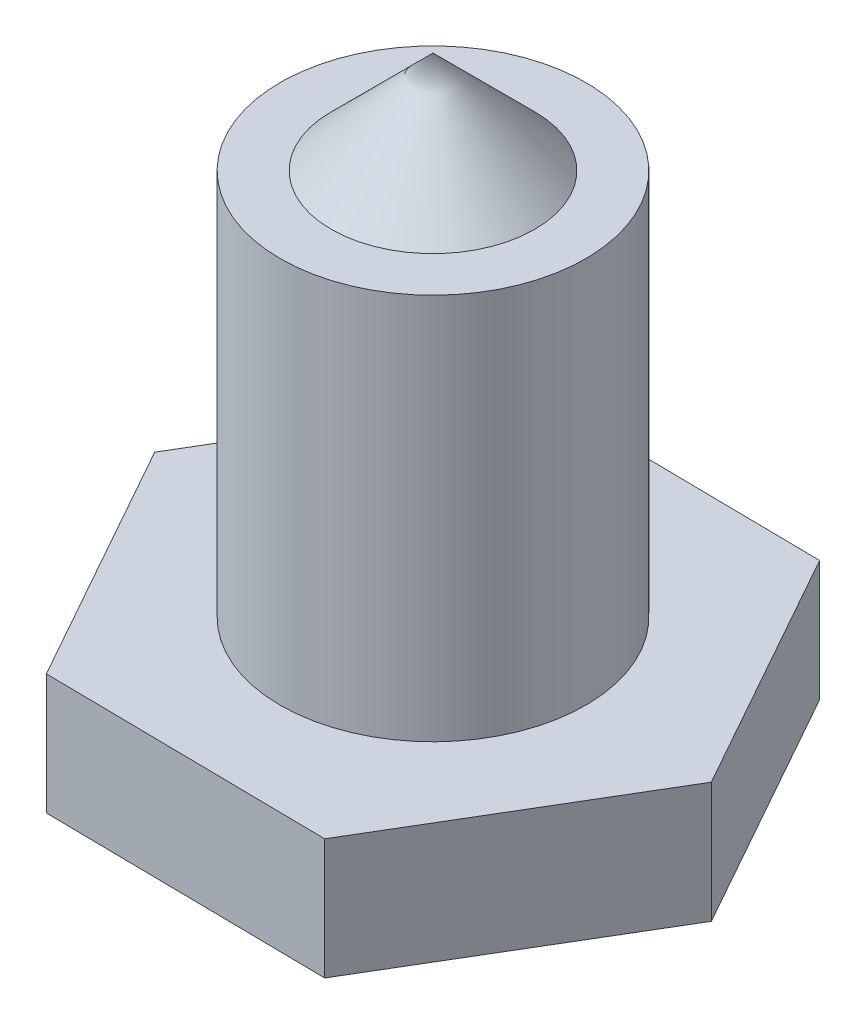
ISO-10303-21;
HEADER;
FILE_DESCRIPTION(('STEP AP214'),'2;1');
FILE_NAME('part.step','',(''),(''),'','','');
FILE_SCHEMA(('AUTOMOTIVE_DESIGN { 1 0 10303 214 1 1 1 1 }'));
ENDSEC;
DATA;
#1=APPLICATION_CONTEXT('core data for automotive mechanical design processes');
#2=APPLICATION_PROTOCOL_DEFINITION('international standard','automotive_design',2000,#1);
#3=PRODUCT_CONTEXT('',#1,'mechanical');
#4=PRODUCT('Part','Part','',(#3));
#5=PRODUCT_RELATED_PRODUCT_CATEGORY('part','',(#4));
#6=PRODUCT_DEFINITION_FORMATION('','',#4);
#7=PRODUCT_DEFINITION_CONTEXT('part definition',#1,'design');
#8=PRODUCT_DEFINITION('design','',#6,#7);
#9=PRODUCT_DEFINITION_SHAPE('','',#8);
#10=(LENGTH_UNIT() NAMED_UNIT(*) SI_UNIT(.MILLI.,.METRE.));
#11=(NAMED_UNIT(*) PLANE_ANGLE_UNIT() SI_UNIT($,.RADIAN.));
#12=(NAMED_UNIT(*) SI_UNIT($,.STERADIAN.) SOLID_ANGLE_UNIT());
#13=UNCERTAINTY_MEASURE_WITH_UNIT(LENGTH_MEASURE(1.E-05),#10,'distance_accuracy_value','');
#14=(GEOMETRIC_REPRESENTATION_CONTEXT(3) GLOBAL_UNCERTAINTY_ASSIGNED_CONTEXT((#13)) GLOBAL_UNIT_ASSIGNED_CONTEXT((#10,
#11,#12)) REPRESENTATION_CONTEXT('',''));
#15=CARTESIAN_POINT('',(0.,0.,0.));
#16=DIRECTION('',(0.,0.,1.));
#17=DIRECTION('',(1.,0.,0.));
#18=AXIS2_PLACEMENT_3D('',#15,#16,#17);
#19=CARTESIAN_POINT('',(10.997565326129,4.7,0.145109949783447));
#20=DIRECTION('',(-0.872546818480198,0.,0.488530500132882));
#21=DIRECTION('',(0.488530500132882,0.,0.872546818480198));
#22=AXIS2_PLACEMENT_3D('',#19,#20,#21);
#23=PLANE('',#22);
#24=DIRECTION('',(-0.488530500132882,0.,-0.872546818480198));
#25=VECTOR('',#24,1.);
#26=CARTESIAN_POINT('',(10.997565326129,0.,0.145109949783447));
#27=LINE('',#26,#25);
#28=CARTESIAN_POINT('',(10.997565326129,0.,0.145109949783447));
#29=VERTEX_POINT('',#28);
#30=CARTESIAN_POINT('',(5.62445156591883,0.,-9.45161597731485));
#31=VERTEX_POINT('',#30);
#32=EDGE_CURVE('E121',#29,#31,#27,.T.);
#33=ORIENTED_EDGE('',*,*,#32,.T.);
#34=DIRECTION('',(0.,-1.,0.));
#35=VECTOR('',#34,1.);
#36=CARTESIAN_POINT('',(5.62445156591883,4.7,-9.45161597731485));
#37=LINE('',#36,#35);
#38=CARTESIAN_POINT('',(5.62445156591883,4.7,-9.45161597731485));
#39=VERTEX_POINT('',#38);
#40=EDGE_CURVE('E42',#39,#31,#37,.T.);
#41=ORIENTED_EDGE('',*,*,#40,.F.);
#42=DIRECTION('',(-0.488530500132882,0.,-0.872546818480198));
#43=VECTOR('',#42,1.);
#44=CARTESIAN_POINT('',(10.997565326129,4.7,0.145109949783447));
#45=LINE('',#44,#43);
#46=CARTESIAN_POINT('',(10.997565326129,4.7,0.145109949783447));
#47=VERTEX_POINT('',#46);
#48=EDGE_CURVE('E132',#47,#39,#45,.T.);
#49=ORIENTED_EDGE('',*,*,#48,.F.);
#50=DIRECTION('',(0.,-1.,0.));
#51=VECTOR('',#50,1.);
#52=CARTESIAN_POINT('',(10.997565326129,4.7,0.145109949783447));
#53=LINE('',#52,#51);
#54=EDGE_CURVE('E117',#47,#29,#53,.T.);
#55=ORIENTED_EDGE('',*,*,#54,.T.);
#56=EDGE_LOOP('',(#33,#41,#49,#55));
#57=FACE_BOUND('',#56,.T.);
#58=ADVANCED_FACE('F34',(#57),#23,.F.);
#59=CARTESIAN_POINT('',(5.62445156591883,4.7,-9.45161597731485));
#60=DIRECTION('',(-0.0131935856015067,0.,0.999912960861582));
#61=DIRECTION('',(0.999912960861582,0.,0.0131935856015067));
#62=AXIS2_PLACEMENT_3D('',#59,#60,#61);
#63=PLANE('',#62);
#64=DIRECTION('',(-0.999912960861582,0.,-0.0131935856015067));
#65=VECTOR('',#64,1.);
#66=CARTESIAN_POINT('',(5.62445156591883,0.,-9.45161597731485));
#67=LINE('',#66,#65);
#68=CARTESIAN_POINT('',(-5.37311376021013,0.,-9.59672592709829));
#69=VERTEX_POINT('',#68);
#70=EDGE_CURVE('E124',#31,#69,#67,.T.);
#71=ORIENTED_EDGE('',*,*,#70,.T.);
#72=DIRECTION('',(0.,-1.,0.));
#73=VECTOR('',#72,1.);
#74=CARTESIAN_POINT('',(-5.37311376021013,4.7,-9.59672592709829));
#75=LINE('',#74,#73);
#76=CARTESIAN_POINT('',(-5.37311376021013,4.7,-9.59672592709829));
#77=VERTEX_POINT('',#76);
#78=EDGE_CURVE('E136',#77,#69,#75,.T.);
#79=ORIENTED_EDGE('',*,*,#78,.F.);
#80=DIRECTION('',(-0.999912960861582,0.,-0.0131935856015067));
#81=VECTOR('',#80,1.);
#82=CARTESIAN_POINT('',(5.62445156591883,4.7,-9.45161597731485));
#83=LINE('',#82,#81);
#84=EDGE_CURVE('E89',#39,#77,#83,.T.);
#85=ORIENTED_EDGE('',*,*,#84,.F.);
#86=ORIENTED_EDGE('',*,*,#40,.T.);
#87=EDGE_LOOP('',(#71,#79,#85,#86));
#88=FACE_BOUND('',#87,.T.);
#89=ADVANCED_FACE('F139',(#88),#63,.F.);
#90=CARTESIAN_POINT('',(-5.37311376021013,4.7,-9.59672592709829));
#91=DIRECTION('',(0.859353232878692,0.,0.5113824607287));
#92=DIRECTION('',(0.5113824607287,0.,-0.859353232878692));
#93=AXIS2_PLACEMENT_3D('',#90,#91,#92);
#94=PLANE('',#93);
#95=DIRECTION('',(-0.5113824607287,0.,0.859353232878692));
#96=VECTOR('',#95,1.);
#97=CARTESIAN_POINT('',(-5.37311376021013,0.,-9.59672592709829));
#98=LINE('',#97,#96);
#99=CARTESIAN_POINT('',(-10.997565326129,0.,-0.145109949783442));
#100=VERTEX_POINT('',#99);
#101=EDGE_CURVE('E127',#69,#100,#98,.T.);
#102=ORIENTED_EDGE('',*,*,#101,.T.);
#103=DIRECTION('',(0.,-1.,0.));
#104=VECTOR('',#103,1.);
#105=CARTESIAN_POINT('',(-10.997565326129,4.7,-0.145109949783442));
#106=LINE('',#105,#104);
#107=CARTESIAN_POINT('',(-10.997565326129,4.7,-0.145109949783442));
#108=VERTEX_POINT('',#107);
#109=EDGE_CURVE('E112',#108,#100,#106,.T.);
#110=ORIENTED_EDGE('',*,*,#109,.F.);
#111=DIRECTION('',(-0.5113824607287,0.,0.859353232878692));
#112=VECTOR('',#111,1.);
#113=CARTESIAN_POINT('',(-5.37311376021013,4.7,-9.59672592709829));
#114=LINE('',#113,#112);
#115=EDGE_CURVE('E103',#77,#108,#114,.T.);
#116=ORIENTED_EDGE('',*,*,#115,.F.);
#117=ORIENTED_EDGE('',*,*,#78,.T.);
#118=EDGE_LOOP('',(#102,#110,#116,#117));
#119=FACE_BOUND('',#118,.T.);
#120=ADVANCED_FACE('F147',(#119),#94,.F.);
#121=CARTESIAN_POINT('',(-10.997565326129,4.7,-0.145109949783442));
#122=DIRECTION('',(0.872546818480198,0.,-0.488530500132882));
#123=DIRECTION('',(-0.488530500132882,0.,-0.872546818480198));
#124=AXIS2_PLACEMENT_3D('',#121,#122,#123);
#125=PLANE('',#124);
#126=DIRECTION('',(0.488530500132882,0.,0.872546818480198));
#127=VECTOR('',#126,1.);
#128=CARTESIAN_POINT('',(-10.997565326129,0.,-0.145109949783442));
#129=LINE('',#128,#127);
#130=CARTESIAN_POINT('',(-5.62445156591882,0.,9.45161597731485));
#131=VERTEX_POINT('',#130);
#132=EDGE_CURVE('E111',#100,#131,#129,.T.);
#133=ORIENTED_EDGE('',*,*,#132,.T.);
#134=DIRECTION('',(0.,-1.,0.));
#135=VECTOR('',#134,1.);
#136=CARTESIAN_POINT('',(-5.62445156591882,4.7,9.45161597731485));
#137=LINE('',#136,#135);
#138=CARTESIAN_POINT('',(-5.62445156591882,4.7,9.45161597731485));
#139=VERTEX_POINT('',#138);
#140=EDGE_CURVE('E108',#139,#131,#137,.T.);
#141=ORIENTED_EDGE('',*,*,#140,.F.);
#142=DIRECTION('',(0.488530500132882,0.,0.872546818480198));
#143=VECTOR('',#142,1.);
#144=CARTESIAN_POINT('',(-10.997565326129,4.7,-0.145109949783442));
#145=LINE('',#144,#143);
#146=EDGE_CURVE('E97',#108,#139,#145,.T.);
#147=ORIENTED_EDGE('',*,*,#146,.F.);
#148=ORIENTED_EDGE('',*,*,#109,.T.);
#149=EDGE_LOOP('',(#133,#141,#147,#148));
#150=FACE_BOUND('',#149,.T.);
#151=ADVANCED_FACE('F109',(#150),#125,.F.);
#152=CARTESIAN_POINT('',(-5.62445156591882,4.7,9.45161597731485));
#153=DIRECTION('',(0.0131935856015065,0.,-0.999912960861582));
#154=DIRECTION('',(-0.999912960861582,0.,-0.0131935856015065));
#155=AXIS2_PLACEMENT_3D('',#152,#153,#154);
#156=PLANE('',#155);
#157=DIRECTION('',(0.999912960861582,0.,0.0131935856015065));
#158=VECTOR('',#157,1.);
#159=CARTESIAN_POINT('',(-5.62445156591882,0.,9.45161597731485));
#160=LINE('',#159,#158);
#161=CARTESIAN_POINT('',(5.37311376021013,0.,9.59672592709829));
#162=VERTEX_POINT('',#161);
#163=EDGE_CURVE('E74',#131,#162,#160,.T.);
#164=ORIENTED_EDGE('',*,*,#163,.T.);
#165=DIRECTION('',(0.,-1.,0.));
#166=VECTOR('',#165,1.);
#167=CARTESIAN_POINT('',(5.37311376021013,4.7,9.59672592709829));
#168=LINE('',#167,#166);
#169=CARTESIAN_POINT('',(5.37311376021013,4.7,9.59672592709829));
#170=VERTEX_POINT('',#169);
#171=EDGE_CURVE('E113',#170,#162,#168,.T.);
#172=ORIENTED_EDGE('',*,*,#171,.F.);
#173=DIRECTION('',(0.999912960861582,0.,0.0131935856015065));
#174=VECTOR('',#173,1.);
#175=CARTESIAN_POINT('',(-5.62445156591882,4.7,9.45161597731485));
#176=LINE('',#175,#174);
#177=EDGE_CURVE('E101',#139,#170,#176,.T.);
#178=ORIENTED_EDGE('',*,*,#177,.F.);
#179=ORIENTED_EDGE('',*,*,#140,.T.);
#180=EDGE_LOOP('',(#164,#172,#178,#179));
#181=FACE_BOUND('',#180,.T.);
#182=ADVANCED_FACE('F115',(#181),#156,.F.);
#183=CARTESIAN_POINT('',(5.37311376021013,4.7,9.59672592709829));
#184=DIRECTION('',(-0.859353232878692,0.,-0.5113824607287));
#185=DIRECTION('',(-0.5113824607287,0.,0.859353232878692));
#186=AXIS2_PLACEMENT_3D('',#183,#184,#185);
#187=PLANE('',#186);
#188=DIRECTION('',(0.5113824607287,0.,-0.859353232878692));
#189=VECTOR('',#188,1.);
#190=CARTESIAN_POINT('',(5.37311376021013,0.,9.59672592709829));
#191=LINE('',#190,#189);
#192=EDGE_CURVE('E80',#162,#29,#191,.T.);
#193=ORIENTED_EDGE('',*,*,#192,.T.);
#194=ORIENTED_EDGE('',*,*,#54,.F.);
#195=DIRECTION('',(0.5113824607287,0.,-0.859353232878692));
#196=VECTOR('',#195,1.);
#197=CARTESIAN_POINT('',(5.37311376021013,4.7,9.59672592709829));
#198=LINE('',#197,#196);
#199=EDGE_CURVE('E50',#170,#47,#198,.T.);
#200=ORIENTED_EDGE('',*,*,#199,.F.);
#201=ORIENTED_EDGE('',*,*,#171,.T.);
#202=EDGE_LOOP('',(#193,#194,#200,#201));
#203=FACE_BOUND('',#202,.T.);
#204=ADVANCED_FACE('F166',(#203),#187,.F.);
#205=CARTESIAN_POINT('',(0.,4.7,0.));
#206=DIRECTION('',(0.,1.,0.));
#207=DIRECTION('',(0.,0.,1.));
#208=AXIS2_PLACEMENT_3D('',#205,#206,#207);
#209=PLANE('',#208);
#210=CARTESIAN_POINT('',(0.,4.7,0.));
#211=DIRECTION('',(0.,1.,0.));
#212=DIRECTION('',(0.,0.,1.));
#213=AXIS2_PLACEMENT_3D('',#210,#211,#212);
#214=CIRCLE('',#213,5.953125);
#215=CARTESIAN_POINT('',(0.,4.7,5.953125));
#216=VERTEX_POINT('',#215);
#217=EDGE_CURVE('E151',#216,#216,#214,.T.);
#218=ORIENTED_EDGE('',*,*,#217,.F.);
#219=EDGE_LOOP('',(#218));
#220=FACE_BOUND('',#219,.T.);
#221=ORIENTED_EDGE('',*,*,#48,.T.);
#222=ORIENTED_EDGE('',*,*,#84,.T.);
#223=ORIENTED_EDGE('',*,*,#115,.T.);
#224=ORIENTED_EDGE('',*,*,#146,.T.);
#225=ORIENTED_EDGE('',*,*,#177,.T.);
#226=ORIENTED_EDGE('',*,*,#199,.T.);
#227=EDGE_LOOP('',(#221,#222,#223,#224,#225,#226));
#228=FACE_BOUND('',#227,.T.);
#229=ADVANCED_FACE('F99',(#220,#228),#209,.T.);
#230=CARTESIAN_POINT('',(0.,0.,0.));
#231=DIRECTION('',(0.,1.,0.));
#232=DIRECTION('',(0.,0.,1.));
#233=AXIS2_PLACEMENT_3D('',#230,#231,#232);
#234=PLANE('',#233);
#235=ORIENTED_EDGE('',*,*,#32,.F.);
#236=ORIENTED_EDGE('',*,*,#192,.F.);
#237=ORIENTED_EDGE('',*,*,#163,.F.);
#238=ORIENTED_EDGE('',*,*,#132,.F.);
#239=ORIENTED_EDGE('',*,*,#101,.F.);
#240=ORIENTED_EDGE('',*,*,#70,.F.);
#241=EDGE_LOOP('',(#235,#236,#237,#238,#239,#240));
#242=FACE_BOUND('',#241,.T.);
#243=ADVANCED_FACE('F144',(#242),#234,.F.);
#244=CARTESIAN_POINT('',(0.,19.78125,0.));
#245=DIRECTION('',(0.,-1.,0.));
#246=DIRECTION('',(0.,0.,-1.));
#247=AXIS2_PLACEMENT_3D('',#244,#245,#246);
#248=CYLINDRICAL_SURFACE('',#247,5.953125);
#249=CARTESIAN_POINT('',(0.,19.78125,0.));
#250=DIRECTION('',(0.,1.,0.));
#251=DIRECTION('',(0.,0.,1.));
#252=AXIS2_PLACEMENT_3D('',#249,#250,#251);
#253=CIRCLE('',#252,5.953125);
#254=CARTESIAN_POINT('',(0.,19.78125,5.953125));
#255=VERTEX_POINT('',#254);
#256=EDGE_CURVE('E125',#255,#255,#253,.T.);
#257=ORIENTED_EDGE('',*,*,#256,.F.);
#258=EDGE_LOOP('',(#257));
#259=FACE_BOUND('',#258,.T.);
#260=ORIENTED_EDGE('',*,*,#217,.T.);
#261=EDGE_LOOP('',(#260));
#262=FACE_BOUND('',#261,.T.);
#263=ADVANCED_FACE('F159',(#259,#262),#248,.T.);
#264=CARTESIAN_POINT('',(0.,19.78125,0.));
#265=DIRECTION('',(0.,1.,0.));
#266=DIRECTION('',(0.,0.,1.));
#267=AXIS2_PLACEMENT_3D('',#264,#265,#266);
#268=PLANE('',#267);
#269=CARTESIAN_POINT('',(0.,19.78125,0.));
#270=DIRECTION('',(0.,1.,0.));
#271=DIRECTION('',(0.,0.,1.));
#272=AXIS2_PLACEMENT_3D('',#269,#270,#271);
#273=CIRCLE('',#272,3.96875);
#274=CARTESIAN_POINT('',(0.,19.78125,3.96875));
#275=VERTEX_POINT('',#274);
#276=EDGE_CURVE('E11',#275,#275,#273,.T.);
#277=ORIENTED_EDGE('',*,*,#276,.F.);
#278=EDGE_LOOP('',(#277));
#279=FACE_BOUND('',#278,.T.);
#280=ORIENTED_EDGE('',*,*,#256,.T.);
#281=EDGE_LOOP('',(#280));
#282=FACE_BOUND('',#281,.T.);
#283=ADVANCED_FACE('F157',(#279,#282),#268,.T.);
#284=CARTESIAN_POINT('',(0.,19.78125,0.));
#285=DIRECTION('',(0.,-1.,0.));
#286=DIRECTION('',(0.,0.,-1.));
#287=AXIS2_PLACEMENT_3D('',#284,#285,#286);
#288=CONICAL_SURFACE('',#287,3.96875,0.785398163397448);
#289=CARTESIAN_POINT('',(0.,23.75,0.));
#290=VERTEX_POINT('',#289);
#291=VERTEX_LOOP('',#290);
#292=FACE_BOUND('',#291,.T.);
#293=ORIENTED_EDGE('',*,*,#276,.T.);
#294=EDGE_LOOP('',(#293));
#295=FACE_BOUND('',#294,.T.);
#296=ADVANCED_FACE('F218',(#292,#295),#288,.T.);
#297=CLOSED_SHELL('',(#58,#89,#120,#151,#182,#204,#229,#243,#263,#283,#296));
#298=MANIFOLD_SOLID_BREP('B2',#297);
#299=ADVANCED_BREP_SHAPE_REPRESENTATION('',(#18,#298),#14);
#300=SHAPE_DEFINITION_REPRESENTATION(#9,#299);
ENDSEC;
END-ISO-10303-21;
